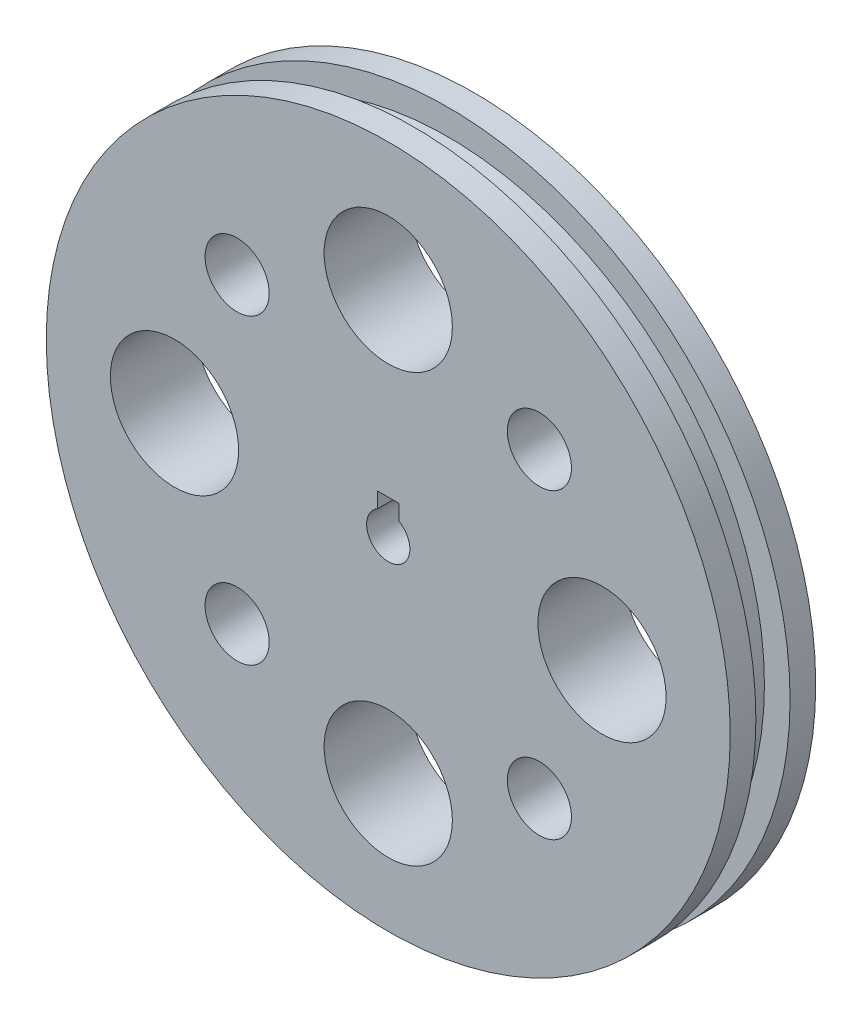
ISO-10303-21;
HEADER;
FILE_DESCRIPTION(('STEP AP214'),'2;1');
FILE_NAME('part.step','',(''),(''),'','','');
FILE_SCHEMA(('AUTOMOTIVE_DESIGN { 1 0 10303 214 1 1 1 1 }'));
ENDSEC;
DATA;
#1=APPLICATION_CONTEXT('core data for automotive mechanical design processes');
#2=APPLICATION_PROTOCOL_DEFINITION('international standard','automotive_design',2000,#1);
#3=PRODUCT_CONTEXT('',#1,'mechanical');
#4=PRODUCT('Part','Part','',(#3));
#5=PRODUCT_RELATED_PRODUCT_CATEGORY('part','',(#4));
#6=PRODUCT_DEFINITION_FORMATION('','',#4);
#7=PRODUCT_DEFINITION_CONTEXT('part definition',#1,'design');
#8=PRODUCT_DEFINITION('design','',#6,#7);
#9=PRODUCT_DEFINITION_SHAPE('','',#8);
#10=(LENGTH_UNIT() NAMED_UNIT(*) SI_UNIT(.MILLI.,.METRE.));
#11=(NAMED_UNIT(*) PLANE_ANGLE_UNIT() SI_UNIT($,.RADIAN.));
#12=(NAMED_UNIT(*) SI_UNIT($,.STERADIAN.) SOLID_ANGLE_UNIT());
#13=UNCERTAINTY_MEASURE_WITH_UNIT(LENGTH_MEASURE(1.E-05),#10,'distance_accuracy_value','');
#14=(GEOMETRIC_REPRESENTATION_CONTEXT(3) GLOBAL_UNCERTAINTY_ASSIGNED_CONTEXT((#13)) GLOBAL_UNIT_ASSIGNED_CONTEXT((#10,
#11,#12)) REPRESENTATION_CONTEXT('',''));
#15=CARTESIAN_POINT('',(0.,0.,0.));
#16=DIRECTION('',(0.,0.,1.));
#17=DIRECTION('',(1.,0.,0.));
#18=AXIS2_PLACEMENT_3D('',#15,#16,#17);
#19=CARTESIAN_POINT('',(0.,0.,7.62));
#20=DIRECTION('',(0.,0.,-1.));
#21=DIRECTION('',(-1.,0.,0.));
#22=AXIS2_PLACEMENT_3D('',#19,#20,#21);
#23=CYLINDRICAL_SURFACE('',#22,101.6);
#24=CARTESIAN_POINT('',(0.,0.,7.62));
#25=DIRECTION('',(0.,0.,1.));
#26=DIRECTION('',(1.,0.,0.));
#27=AXIS2_PLACEMENT_3D('',#24,#25,#26);
#28=CIRCLE('',#27,101.6);
#29=CARTESIAN_POINT('',(101.6,0.,7.62));
#30=VERTEX_POINT('',#29);
#31=EDGE_CURVE('E161',#30,#30,#28,.T.);
#32=ORIENTED_EDGE('',*,*,#31,.F.);
#33=EDGE_LOOP('',(#32));
#34=FACE_BOUND('',#33,.T.);
#35=CARTESIAN_POINT('',(0.,0.,0.));
#36=DIRECTION('',(0.,0.,1.));
#37=DIRECTION('',(1.,0.,0.));
#38=AXIS2_PLACEMENT_3D('',#35,#36,#37);
#39=CIRCLE('',#38,101.6);
#40=CARTESIAN_POINT('',(101.6,0.,0.));
#41=VERTEX_POINT('',#40);
#42=EDGE_CURVE('E157',#41,#41,#39,.T.);
#43=ORIENTED_EDGE('',*,*,#42,.T.);
#44=EDGE_LOOP('',(#43));
#45=FACE_BOUND('',#44,.T.);
#46=ADVANCED_FACE('F32',(#34,#45),#23,.T.);
#47=CARTESIAN_POINT('',(0.,0.,7.62));
#48=DIRECTION('',(0.,0.,1.));
#49=DIRECTION('',(1.,0.,0.));
#50=AXIS2_PLACEMENT_3D('',#47,#48,#49);
#51=PLANE('',#50);
#52=CARTESIAN_POINT('',(0.,0.,7.62));
#53=DIRECTION('',(0.,0.,1.));
#54=DIRECTION('',(1.,0.,0.));
#55=AXIS2_PLACEMENT_3D('',#52,#53,#54);
#56=CIRCLE('',#55,93.98);
#57=CARTESIAN_POINT('',(93.98,0.,7.62));
#58=VERTEX_POINT('',#57);
#59=EDGE_CURVE('E158',#58,#58,#56,.T.);
#60=ORIENTED_EDGE('',*,*,#59,.F.);
#61=EDGE_LOOP('',(#60));
#62=FACE_BOUND('',#61,.T.);
#63=ORIENTED_EDGE('',*,*,#31,.T.);
#64=EDGE_LOOP('',(#63));
#65=FACE_BOUND('',#64,.T.);
#66=ADVANCED_FACE('F185',(#62,#65),#51,.T.);
#67=CARTESIAN_POINT('',(0.,0.,0.));
#68=DIRECTION('',(0.,0.,1.));
#69=DIRECTION('',(1.,0.,0.));
#70=AXIS2_PLACEMENT_3D('',#67,#68,#69);
#71=PLANE('',#70);
#72=CARTESIAN_POINT('',(0.,0.,0.));
#73=DIRECTION('',(0.,0.,1.));
#74=DIRECTION('',(1.,0.,0.));
#75=AXIS2_PLACEMENT_3D('',#72,#73,#74);
#76=CIRCLE('',#75,6.42700311187104);
#77=CARTESIAN_POINT('',(-3.175,5.588,0.));
#78=VERTEX_POINT('',#77);
#79=CARTESIAN_POINT('',(3.175,5.588,0.));
#80=VERTEX_POINT('',#79);
#81=EDGE_CURVE('E39',#78,#80,#76,.T.);
#82=ORIENTED_EDGE('',*,*,#81,.T.);
#83=DIRECTION('',(0.,1.,0.));
#84=VECTOR('',#83,1.);
#85=CARTESIAN_POINT('',(3.175,0.,0.));
#86=LINE('',#85,#84);
#87=CARTESIAN_POINT('',(3.175,10.16,0.));
#88=VERTEX_POINT('',#87);
#89=EDGE_CURVE('E11',#80,#88,#86,.T.);
#90=ORIENTED_EDGE('',*,*,#89,.T.);
#91=DIRECTION('',(-1.,0.,0.));
#92=VECTOR('',#91,1.);
#93=CARTESIAN_POINT('',(0.,10.16,0.));
#94=LINE('',#93,#92);
#95=CARTESIAN_POINT('',(-3.175,10.16,0.));
#96=VERTEX_POINT('',#95);
#97=EDGE_CURVE('E78',#88,#96,#94,.T.);
#98=ORIENTED_EDGE('',*,*,#97,.T.);
#99=DIRECTION('',(0.,-1.,0.));
#100=VECTOR('',#99,1.);
#101=CARTESIAN_POINT('',(-3.175,0.,0.));
#102=LINE('',#101,#100);
#103=EDGE_CURVE('E167',#96,#78,#102,.T.);
#104=ORIENTED_EDGE('',*,*,#103,.T.);
#105=EDGE_LOOP('',(#82,#90,#98,#104));
#106=FACE_BOUND('',#105,.T.);
#107=CARTESIAN_POINT('',(-44.901280605346,-44.9012806053455,0.));
#108=DIRECTION('',(0.,0.,1.));
#109=DIRECTION('',(1.,0.,0.));
#110=AXIS2_PLACEMENT_3D('',#107,#108,#109);
#111=CIRCLE('',#110,9.525);
#112=CARTESIAN_POINT('',(-35.376280605346,-44.9012806053455,0.));
#113=VERTEX_POINT('',#112);
#114=EDGE_CURVE('E145',#113,#113,#111,.F.);
#115=ORIENTED_EDGE('',*,*,#114,.F.);
#116=EDGE_LOOP('',(#115));
#117=FACE_BOUND('',#116,.T.);
#118=CARTESIAN_POINT('',(0.,-63.5,0.));
#119=DIRECTION('',(0.,0.,1.));
#120=DIRECTION('',(1.,0.,0.));
#121=AXIS2_PLACEMENT_3D('',#118,#119,#120);
#122=CIRCLE('',#121,19.05);
#123=CARTESIAN_POINT('',(19.05,-63.5,0.));
#124=VERTEX_POINT('',#123);
#125=EDGE_CURVE('E142',#124,#124,#122,.F.);
#126=ORIENTED_EDGE('',*,*,#125,.F.);
#127=EDGE_LOOP('',(#126));
#128=FACE_BOUND('',#127,.T.);
#129=CARTESIAN_POINT('',(44.9012806053455,-44.901280605346,0.));
#130=DIRECTION('',(0.,0.,1.));
#131=DIRECTION('',(1.,0.,0.));
#132=AXIS2_PLACEMENT_3D('',#129,#130,#131);
#133=CIRCLE('',#132,9.525);
#134=CARTESIAN_POINT('',(54.4262806053455,-44.901280605346,0.));
#135=VERTEX_POINT('',#134);
#136=EDGE_CURVE('E139',#135,#135,#133,.F.);
#137=ORIENTED_EDGE('',*,*,#136,.F.);
#138=EDGE_LOOP('',(#137));
#139=FACE_BOUND('',#138,.T.);
#140=CARTESIAN_POINT('',(63.5,0.,0.));
#141=DIRECTION('',(0.,0.,1.));
#142=DIRECTION('',(1.,0.,0.));
#143=AXIS2_PLACEMENT_3D('',#140,#141,#142);
#144=CIRCLE('',#143,19.05);
#145=CARTESIAN_POINT('',(82.55,0.,0.));
#146=VERTEX_POINT('',#145);
#147=EDGE_CURVE('E136',#146,#146,#144,.F.);
#148=ORIENTED_EDGE('',*,*,#147,.F.);
#149=EDGE_LOOP('',(#148));
#150=FACE_BOUND('',#149,.T.);
#151=CARTESIAN_POINT('',(44.901280605346,44.9012806053455,0.));
#152=DIRECTION('',(0.,0.,1.));
#153=DIRECTION('',(1.,0.,0.));
#154=AXIS2_PLACEMENT_3D('',#151,#152,#153);
#155=CIRCLE('',#154,9.525);
#156=CARTESIAN_POINT('',(54.426280605346,44.9012806053455,0.));
#157=VERTEX_POINT('',#156);
#158=EDGE_CURVE('E133',#157,#157,#155,.F.);
#159=ORIENTED_EDGE('',*,*,#158,.F.);
#160=EDGE_LOOP('',(#159));
#161=FACE_BOUND('',#160,.T.);
#162=CARTESIAN_POINT('',(0.,63.5,0.));
#163=DIRECTION('',(0.,0.,1.));
#164=DIRECTION('',(1.,0.,0.));
#165=AXIS2_PLACEMENT_3D('',#162,#163,#164);
#166=CIRCLE('',#165,19.05);
#167=CARTESIAN_POINT('',(19.05,63.5,0.));
#168=VERTEX_POINT('',#167);
#169=EDGE_CURVE('E130',#168,#168,#166,.F.);
#170=ORIENTED_EDGE('',*,*,#169,.F.);
#171=EDGE_LOOP('',(#170));
#172=FACE_BOUND('',#171,.T.);
#173=CARTESIAN_POINT('',(-44.9012806053455,44.901280605346,0.));
#174=DIRECTION('',(0.,0.,1.));
#175=DIRECTION('',(1.,0.,0.));
#176=AXIS2_PLACEMENT_3D('',#173,#174,#175);
#177=CIRCLE('',#176,9.525);
#178=CARTESIAN_POINT('',(-35.3762806053455,44.901280605346,0.));
#179=VERTEX_POINT('',#178);
#180=EDGE_CURVE('E127',#179,#179,#177,.F.);
#181=ORIENTED_EDGE('',*,*,#180,.F.);
#182=EDGE_LOOP('',(#181));
#183=FACE_BOUND('',#182,.T.);
#184=CARTESIAN_POINT('',(-63.5,0.,0.));
#185=DIRECTION('',(0.,0.,1.));
#186=DIRECTION('',(1.,0.,0.));
#187=AXIS2_PLACEMENT_3D('',#184,#185,#186);
#188=CIRCLE('',#187,19.05);
#189=CARTESIAN_POINT('',(-44.45,0.,0.));
#190=VERTEX_POINT('',#189);
#191=EDGE_CURVE('E124',#190,#190,#188,.F.);
#192=ORIENTED_EDGE('',*,*,#191,.F.);
#193=EDGE_LOOP('',(#192));
#194=FACE_BOUND('',#193,.T.);
#195=ORIENTED_EDGE('',*,*,#42,.F.);
#196=EDGE_LOOP('',(#195));
#197=FACE_BOUND('',#196,.T.);
#198=ADVANCED_FACE('F171',(#106,#117,#128,#139,#150,#161,#172,#183,#194,#197),#71,.F.);
#199=CARTESIAN_POINT('',(0.,0.,17.78));
#200=DIRECTION('',(0.,0.,-1.));
#201=DIRECTION('',(-1.,0.,0.));
#202=AXIS2_PLACEMENT_3D('',#199,#200,#201);
#203=CYLINDRICAL_SURFACE('',#202,93.98);
#204=CARTESIAN_POINT('',(0.,0.,17.78));
#205=DIRECTION('',(0.,0.,1.));
#206=DIRECTION('',(1.,0.,0.));
#207=AXIS2_PLACEMENT_3D('',#204,#205,#206);
#208=CIRCLE('',#207,93.98);
#209=CARTESIAN_POINT('',(93.98,0.,17.78));
#210=VERTEX_POINT('',#209);
#211=EDGE_CURVE('E152',#210,#210,#208,.T.);
#212=ORIENTED_EDGE('',*,*,#211,.F.);
#213=EDGE_LOOP('',(#212));
#214=FACE_BOUND('',#213,.T.);
#215=ORIENTED_EDGE('',*,*,#59,.T.);
#216=EDGE_LOOP('',(#215));
#217=FACE_BOUND('',#216,.T.);
#218=ADVANCED_FACE('F197',(#214,#217),#203,.T.);
#219=CARTESIAN_POINT('',(0.,0.,25.4));
#220=DIRECTION('',(0.,0.,-1.));
#221=DIRECTION('',(-1.,0.,0.));
#222=AXIS2_PLACEMENT_3D('',#219,#220,#221);
#223=CYLINDRICAL_SURFACE('',#222,101.6);
#224=CARTESIAN_POINT('',(0.,0.,25.4));
#225=DIRECTION('',(0.,0.,1.));
#226=DIRECTION('',(1.,0.,0.));
#227=AXIS2_PLACEMENT_3D('',#224,#225,#226);
#228=CIRCLE('',#227,101.6);
#229=CARTESIAN_POINT('',(101.6,0.,25.4));
#230=VERTEX_POINT('',#229);
#231=EDGE_CURVE('E149',#230,#230,#228,.T.);
#232=ORIENTED_EDGE('',*,*,#231,.F.);
#233=EDGE_LOOP('',(#232));
#234=FACE_BOUND('',#233,.T.);
#235=CARTESIAN_POINT('',(0.,0.,17.78));
#236=DIRECTION('',(0.,0.,1.));
#237=DIRECTION('',(1.,0.,0.));
#238=AXIS2_PLACEMENT_3D('',#235,#236,#237);
#239=CIRCLE('',#238,101.6);
#240=CARTESIAN_POINT('',(101.6,0.,17.78));
#241=VERTEX_POINT('',#240);
#242=EDGE_CURVE('E148',#241,#241,#239,.T.);
#243=ORIENTED_EDGE('',*,*,#242,.T.);
#244=EDGE_LOOP('',(#243));
#245=FACE_BOUND('',#244,.T.);
#246=ADVANCED_FACE('F201',(#234,#245),#223,.T.);
#247=CARTESIAN_POINT('',(0.,0.,25.4));
#248=DIRECTION('',(0.,0.,1.));
#249=DIRECTION('',(1.,0.,0.));
#250=AXIS2_PLACEMENT_3D('',#247,#248,#249);
#251=PLANE('',#250);
#252=DIRECTION('',(-1.,0.,0.));
#253=VECTOR('',#252,1.);
#254=CARTESIAN_POINT('',(-3.175,10.16,25.4));
#255=LINE('',#254,#253);
#256=CARTESIAN_POINT('',(3.175,10.16,25.4));
#257=VERTEX_POINT('',#256);
#258=CARTESIAN_POINT('',(-3.175,10.16,25.4));
#259=VERTEX_POINT('',#258);
#260=EDGE_CURVE('E75',#257,#259,#255,.T.);
#261=ORIENTED_EDGE('',*,*,#260,.F.);
#262=DIRECTION('',(0.,1.,0.));
#263=VECTOR('',#262,1.);
#264=CARTESIAN_POINT('',(3.175,5.588,25.4));
#265=LINE('',#264,#263);
#266=CARTESIAN_POINT('',(3.175,5.588,25.4));
#267=VERTEX_POINT('',#266);
#268=EDGE_CURVE('E83',#267,#257,#265,.T.);
#269=ORIENTED_EDGE('',*,*,#268,.F.);
#270=CARTESIAN_POINT('',(0.,0.,25.4));
#271=DIRECTION('',(0.,0.,1.));
#272=DIRECTION('',(1.,0.,0.));
#273=AXIS2_PLACEMENT_3D('',#270,#271,#272);
#274=CIRCLE('',#273,6.42700311187104);
#275=CARTESIAN_POINT('',(-3.175,5.588,25.4));
#276=VERTEX_POINT('',#275);
#277=EDGE_CURVE('E80',#276,#267,#274,.T.);
#278=ORIENTED_EDGE('',*,*,#277,.F.);
#279=DIRECTION('',(0.,-1.,0.));
#280=VECTOR('',#279,1.);
#281=CARTESIAN_POINT('',(-3.175,5.588,25.4));
#282=LINE('',#281,#280);
#283=EDGE_CURVE('E92',#259,#276,#282,.T.);
#284=ORIENTED_EDGE('',*,*,#283,.F.);
#285=EDGE_LOOP('',(#261,#269,#278,#284));
#286=FACE_BOUND('',#285,.T.);
#287=CARTESIAN_POINT('',(-44.901280605346,-44.9012806053455,25.4));
#288=DIRECTION('',(0.,0.,1.));
#289=DIRECTION('',(1.,0.,0.));
#290=AXIS2_PLACEMENT_3D('',#287,#288,#289);
#291=CIRCLE('',#290,9.525);
#292=CARTESIAN_POINT('',(-35.376280605346,-44.9012806053455,25.4));
#293=VERTEX_POINT('',#292);
#294=EDGE_CURVE('E98',#293,#293,#291,.T.);
#295=ORIENTED_EDGE('',*,*,#294,.F.);
#296=EDGE_LOOP('',(#295));
#297=FACE_BOUND('',#296,.T.);
#298=CARTESIAN_POINT('',(0.,-63.5,25.4));
#299=DIRECTION('',(0.,0.,1.));
#300=DIRECTION('',(1.,0.,0.));
#301=AXIS2_PLACEMENT_3D('',#298,#299,#300);
#302=CIRCLE('',#301,19.05);
#303=CARTESIAN_POINT('',(19.05,-63.5,25.4));
#304=VERTEX_POINT('',#303);
#305=EDGE_CURVE('E117',#304,#304,#302,.T.);
#306=ORIENTED_EDGE('',*,*,#305,.F.);
#307=EDGE_LOOP('',(#306));
#308=FACE_BOUND('',#307,.T.);
#309=CARTESIAN_POINT('',(44.9012806053455,-44.901280605346,25.4));
#310=DIRECTION('',(0.,0.,1.));
#311=DIRECTION('',(1.,0.,0.));
#312=AXIS2_PLACEMENT_3D('',#309,#310,#311);
#313=CIRCLE('',#312,9.525);
#314=CARTESIAN_POINT('',(54.4262806053455,-44.901280605346,25.4));
#315=VERTEX_POINT('',#314);
#316=EDGE_CURVE('E114',#315,#315,#313,.T.);
#317=ORIENTED_EDGE('',*,*,#316,.F.);
#318=EDGE_LOOP('',(#317));
#319=FACE_BOUND('',#318,.T.);
#320=CARTESIAN_POINT('',(63.5,0.,25.4));
#321=DIRECTION('',(0.,0.,1.));
#322=DIRECTION('',(1.,0.,0.));
#323=AXIS2_PLACEMENT_3D('',#320,#321,#322);
#324=CIRCLE('',#323,19.05);
#325=CARTESIAN_POINT('',(82.55,0.,25.4));
#326=VERTEX_POINT('',#325);
#327=EDGE_CURVE('E111',#326,#326,#324,.T.);
#328=ORIENTED_EDGE('',*,*,#327,.F.);
#329=EDGE_LOOP('',(#328));
#330=FACE_BOUND('',#329,.T.);
#331=CARTESIAN_POINT('',(44.901280605346,44.9012806053455,25.4));
#332=DIRECTION('',(0.,0.,1.));
#333=DIRECTION('',(1.,0.,0.));
#334=AXIS2_PLACEMENT_3D('',#331,#332,#333);
#335=CIRCLE('',#334,9.525);
#336=CARTESIAN_POINT('',(54.426280605346,44.9012806053455,25.4));
#337=VERTEX_POINT('',#336);
#338=EDGE_CURVE('E108',#337,#337,#335,.T.);
#339=ORIENTED_EDGE('',*,*,#338,.F.);
#340=EDGE_LOOP('',(#339));
#341=FACE_BOUND('',#340,.T.);
#342=CARTESIAN_POINT('',(0.,63.5,25.4));
#343=DIRECTION('',(0.,0.,1.));
#344=DIRECTION('',(1.,0.,0.));
#345=AXIS2_PLACEMENT_3D('',#342,#343,#344);
#346=CIRCLE('',#345,19.05);
#347=CARTESIAN_POINT('',(19.05,63.5,25.4));
#348=VERTEX_POINT('',#347);
#349=EDGE_CURVE('E105',#348,#348,#346,.T.);
#350=ORIENTED_EDGE('',*,*,#349,.F.);
#351=EDGE_LOOP('',(#350));
#352=FACE_BOUND('',#351,.T.);
#353=CARTESIAN_POINT('',(-44.9012806053455,44.901280605346,25.4));
#354=DIRECTION('',(0.,0.,1.));
#355=DIRECTION('',(1.,0.,0.));
#356=AXIS2_PLACEMENT_3D('',#353,#354,#355);
#357=CIRCLE('',#356,9.525);
#358=CARTESIAN_POINT('',(-35.3762806053455,44.901280605346,25.4));
#359=VERTEX_POINT('',#358);
#360=EDGE_CURVE('E101',#359,#359,#357,.T.);
#361=ORIENTED_EDGE('',*,*,#360,.F.);
#362=EDGE_LOOP('',(#361));
#363=FACE_BOUND('',#362,.T.);
#364=CARTESIAN_POINT('',(-63.5,0.,25.4));
#365=DIRECTION('',(0.,0.,1.));
#366=DIRECTION('',(1.,0.,0.));
#367=AXIS2_PLACEMENT_3D('',#364,#365,#366);
#368=CIRCLE('',#367,19.05);
#369=CARTESIAN_POINT('',(-44.45,0.,25.4));
#370=VERTEX_POINT('',#369);
#371=EDGE_CURVE('E104',#370,#370,#368,.T.);
#372=ORIENTED_EDGE('',*,*,#371,.F.);
#373=EDGE_LOOP('',(#372));
#374=FACE_BOUND('',#373,.T.);
#375=ORIENTED_EDGE('',*,*,#231,.T.);
#376=EDGE_LOOP('',(#375));
#377=FACE_BOUND('',#376,.T.);
#378=ADVANCED_FACE('F90',(#286,#297,#308,#319,#330,#341,#352,#363,#374,#377),#251,.T.);
#379=CARTESIAN_POINT('',(0.,0.,17.78));
#380=DIRECTION('',(0.,0.,1.));
#381=DIRECTION('',(1.,0.,0.));
#382=AXIS2_PLACEMENT_3D('',#379,#380,#381);
#383=PLANE('',#382);
#384=ORIENTED_EDGE('',*,*,#211,.T.);
#385=EDGE_LOOP('',(#384));
#386=FACE_BOUND('',#385,.T.);
#387=ORIENTED_EDGE('',*,*,#242,.F.);
#388=EDGE_LOOP('',(#387));
#389=FACE_BOUND('',#388,.T.);
#390=ADVANCED_FACE('F208',(#386,#389),#383,.F.);
#391=CARTESIAN_POINT('',(-63.5,0.,25.4));
#392=DIRECTION('',(0.,0.,-1.));
#393=DIRECTION('',(-1.,0.,0.));
#394=AXIS2_PLACEMENT_3D('',#391,#392,#393);
#395=CYLINDRICAL_SURFACE('',#394,19.05);
#396=ORIENTED_EDGE('',*,*,#371,.T.);
#397=EDGE_LOOP('',(#396));
#398=FACE_BOUND('',#397,.T.);
#399=ORIENTED_EDGE('',*,*,#191,.T.);
#400=EDGE_LOOP('',(#399));
#401=FACE_BOUND('',#400,.T.);
#402=ADVANCED_FACE('F211',(#398,#401),#395,.F.);
#403=CARTESIAN_POINT('',(-44.9012806053455,44.901280605346,25.4));
#404=DIRECTION('',(0.,0.,-1.));
#405=DIRECTION('',(-1.,0.,0.));
#406=AXIS2_PLACEMENT_3D('',#403,#404,#405);
#407=CYLINDRICAL_SURFACE('',#406,9.525);
#408=ORIENTED_EDGE('',*,*,#360,.T.);
#409=EDGE_LOOP('',(#408));
#410=FACE_BOUND('',#409,.T.);
#411=ORIENTED_EDGE('',*,*,#180,.T.);
#412=EDGE_LOOP('',(#411));
#413=FACE_BOUND('',#412,.T.);
#414=ADVANCED_FACE('F217',(#410,#413),#407,.F.);
#415=CARTESIAN_POINT('',(0.,63.5,25.4));
#416=DIRECTION('',(0.,0.,-1.));
#417=DIRECTION('',(-1.,0.,0.));
#418=AXIS2_PLACEMENT_3D('',#415,#416,#417);
#419=CYLINDRICAL_SURFACE('',#418,19.05);
#420=ORIENTED_EDGE('',*,*,#349,.T.);
#421=EDGE_LOOP('',(#420));
#422=FACE_BOUND('',#421,.T.);
#423=ORIENTED_EDGE('',*,*,#169,.T.);
#424=EDGE_LOOP('',(#423));
#425=FACE_BOUND('',#424,.T.);
#426=ADVANCED_FACE('F238',(#422,#425),#419,.F.);
#427=CARTESIAN_POINT('',(44.901280605346,44.9012806053455,25.4));
#428=DIRECTION('',(0.,0.,-1.));
#429=DIRECTION('',(-1.,0.,0.));
#430=AXIS2_PLACEMENT_3D('',#427,#428,#429);
#431=CYLINDRICAL_SURFACE('',#430,9.525);
#432=ORIENTED_EDGE('',*,*,#338,.T.);
#433=EDGE_LOOP('',(#432));
#434=FACE_BOUND('',#433,.T.);
#435=ORIENTED_EDGE('',*,*,#158,.T.);
#436=EDGE_LOOP('',(#435));
#437=FACE_BOUND('',#436,.T.);
#438=ADVANCED_FACE('F234',(#434,#437),#431,.F.);
#439=CARTESIAN_POINT('',(63.5,0.,25.4));
#440=DIRECTION('',(0.,0.,-1.));
#441=DIRECTION('',(-1.,0.,0.));
#442=AXIS2_PLACEMENT_3D('',#439,#440,#441);
#443=CYLINDRICAL_SURFACE('',#442,19.05);
#444=ORIENTED_EDGE('',*,*,#327,.T.);
#445=EDGE_LOOP('',(#444));
#446=FACE_BOUND('',#445,.T.);
#447=ORIENTED_EDGE('',*,*,#147,.T.);
#448=EDGE_LOOP('',(#447));
#449=FACE_BOUND('',#448,.T.);
#450=ADVANCED_FACE('F230',(#446,#449),#443,.F.);
#451=CARTESIAN_POINT('',(44.9012806053455,-44.901280605346,25.4));
#452=DIRECTION('',(0.,0.,-1.));
#453=DIRECTION('',(-1.,0.,0.));
#454=AXIS2_PLACEMENT_3D('',#451,#452,#453);
#455=CYLINDRICAL_SURFACE('',#454,9.525);
#456=ORIENTED_EDGE('',*,*,#316,.T.);
#457=EDGE_LOOP('',(#456));
#458=FACE_BOUND('',#457,.T.);
#459=ORIENTED_EDGE('',*,*,#136,.T.);
#460=EDGE_LOOP('',(#459));
#461=FACE_BOUND('',#460,.T.);
#462=ADVANCED_FACE('F226',(#458,#461),#455,.F.);
#463=CARTESIAN_POINT('',(0.,-63.5,25.4));
#464=DIRECTION('',(0.,0.,-1.));
#465=DIRECTION('',(-1.,0.,0.));
#466=AXIS2_PLACEMENT_3D('',#463,#464,#465);
#467=CYLINDRICAL_SURFACE('',#466,19.05);
#468=ORIENTED_EDGE('',*,*,#305,.T.);
#469=EDGE_LOOP('',(#468));
#470=FACE_BOUND('',#469,.T.);
#471=ORIENTED_EDGE('',*,*,#125,.T.);
#472=EDGE_LOOP('',(#471));
#473=FACE_BOUND('',#472,.T.);
#474=ADVANCED_FACE('F222',(#470,#473),#467,.F.);
#475=CARTESIAN_POINT('',(-44.901280605346,-44.9012806053455,25.4));
#476=DIRECTION('',(0.,0.,-1.));
#477=DIRECTION('',(-1.,0.,0.));
#478=AXIS2_PLACEMENT_3D('',#475,#476,#477);
#479=CYLINDRICAL_SURFACE('',#478,9.525);
#480=ORIENTED_EDGE('',*,*,#294,.T.);
#481=EDGE_LOOP('',(#480));
#482=FACE_BOUND('',#481,.T.);
#483=ORIENTED_EDGE('',*,*,#114,.T.);
#484=EDGE_LOOP('',(#483));
#485=FACE_BOUND('',#484,.T.);
#486=ADVANCED_FACE('F219',(#482,#485),#479,.F.);
#487=CARTESIAN_POINT('',(3.175,5.588,-17.78));
#488=DIRECTION('',(1.,0.,0.));
#489=DIRECTION('',(0.,0.,-1.));
#490=AXIS2_PLACEMENT_3D('',#487,#488,#489);
#491=PLANE('',#490);
#492=DIRECTION('',(0.,0.,1.));
#493=VECTOR('',#492,1.);
#494=CARTESIAN_POINT('',(3.175,5.588,-17.78));
#495=LINE('',#494,#493);
#496=EDGE_CURVE('E86',#80,#267,#495,.T.);
#497=ORIENTED_EDGE('',*,*,#496,.T.);
#498=ORIENTED_EDGE('',*,*,#268,.T.);
#499=DIRECTION('',(0.,0.,1.));
#500=VECTOR('',#499,1.);
#501=CARTESIAN_POINT('',(3.175,10.16,-17.78));
#502=LINE('',#501,#500);
#503=EDGE_CURVE('E71',#88,#257,#502,.T.);
#504=ORIENTED_EDGE('',*,*,#503,.F.);
#505=ORIENTED_EDGE('',*,*,#89,.F.);
#506=EDGE_LOOP('',(#497,#498,#504,#505));
#507=FACE_BOUND('',#506,.T.);
#508=ADVANCED_FACE('F84',(#507),#491,.F.);
#509=CARTESIAN_POINT('',(0.,0.,-17.78));
#510=DIRECTION('',(0.,0.,1.));
#511=DIRECTION('',(1.,0.,0.));
#512=AXIS2_PLACEMENT_3D('',#509,#510,#511);
#513=CYLINDRICAL_SURFACE('',#512,6.42700311187104);
#514=DIRECTION('',(0.,0.,1.));
#515=VECTOR('',#514,1.);
#516=CARTESIAN_POINT('',(-3.175,5.588,-17.78));
#517=LINE('',#516,#515);
#518=EDGE_CURVE('E46',#78,#276,#517,.T.);
#519=ORIENTED_EDGE('',*,*,#518,.T.);
#520=ORIENTED_EDGE('',*,*,#277,.T.);
#521=ORIENTED_EDGE('',*,*,#496,.F.);
#522=ORIENTED_EDGE('',*,*,#81,.F.);
#523=EDGE_LOOP('',(#519,#520,#521,#522));
#524=FACE_BOUND('',#523,.T.);
#525=ADVANCED_FACE('F173',(#524),#513,.F.);
#526=CARTESIAN_POINT('',(-3.175,5.588,-17.78));
#527=DIRECTION('',(-1.,0.,0.));
#528=DIRECTION('',(0.,0.,1.));
#529=AXIS2_PLACEMENT_3D('',#526,#527,#528);
#530=PLANE('',#529);
#531=DIRECTION('',(0.,0.,1.));
#532=VECTOR('',#531,1.);
#533=CARTESIAN_POINT('',(-3.175,10.16,-17.78));
#534=LINE('',#533,#532);
#535=EDGE_CURVE('E54',#96,#259,#534,.T.);
#536=ORIENTED_EDGE('',*,*,#535,.T.);
#537=ORIENTED_EDGE('',*,*,#283,.T.);
#538=ORIENTED_EDGE('',*,*,#518,.F.);
#539=ORIENTED_EDGE('',*,*,#103,.F.);
#540=EDGE_LOOP('',(#536,#537,#538,#539));
#541=FACE_BOUND('',#540,.T.);
#542=ADVANCED_FACE('F175',(#541),#530,.F.);
#543=CARTESIAN_POINT('',(-3.175,10.16,-17.78));
#544=DIRECTION('',(0.,1.,0.));
#545=DIRECTION('',(0.,0.,1.));
#546=AXIS2_PLACEMENT_3D('',#543,#544,#545);
#547=PLANE('',#546);
#548=ORIENTED_EDGE('',*,*,#503,.T.);
#549=ORIENTED_EDGE('',*,*,#260,.T.);
#550=ORIENTED_EDGE('',*,*,#535,.F.);
#551=ORIENTED_EDGE('',*,*,#97,.F.);
#552=EDGE_LOOP('',(#548,#549,#550,#551));
#553=FACE_BOUND('',#552,.T.);
#554=ADVANCED_FACE('F73',(#553),#547,.F.);
#555=CLOSED_SHELL('',(#46,#66,#198,#218,#246,#378,#390,#402,#414,#426,#438,#450,#462,#474,#486,
#508,#525,#542,#554));
#556=MANIFOLD_SOLID_BREP('B2',#555);
#557=ADVANCED_BREP_SHAPE_REPRESENTATION('',(#18,#556),#14);
#558=SHAPE_DEFINITION_REPRESENTATION(#9,#557);
ENDSEC;
END-ISO-10303-21;
